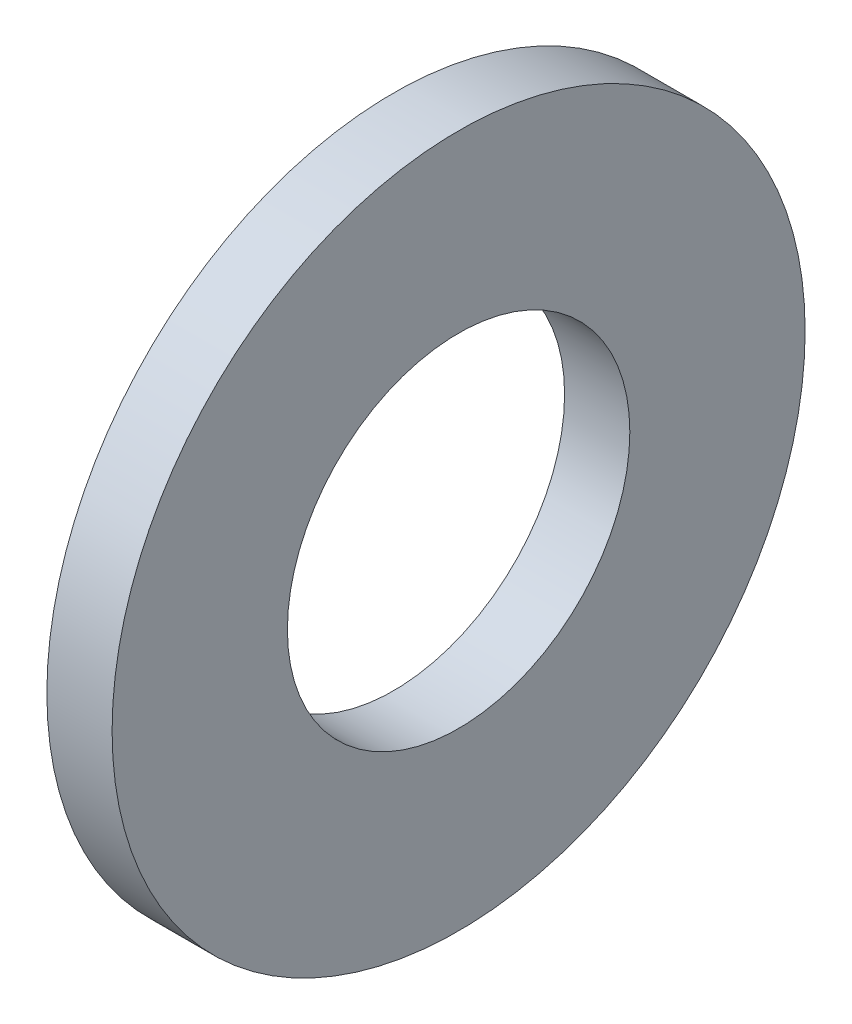
ISO-10303-21;
HEADER;
FILE_DESCRIPTION(('STEP AP214'),'2;1');
FILE_NAME('part.step','',(''),(''),'','','');
FILE_SCHEMA(('AUTOMOTIVE_DESIGN { 1 0 10303 214 1 1 1 1 }'));
ENDSEC;
DATA;
#1=APPLICATION_CONTEXT('core data for automotive mechanical design processes');
#2=APPLICATION_PROTOCOL_DEFINITION('international standard','automotive_design',2000,#1);
#3=PRODUCT_CONTEXT('',#1,'mechanical');
#4=PRODUCT('Part','Part','',(#3));
#5=PRODUCT_RELATED_PRODUCT_CATEGORY('part','',(#4));
#6=PRODUCT_DEFINITION_FORMATION('','',#4);
#7=PRODUCT_DEFINITION_CONTEXT('part definition',#1,'design');
#8=PRODUCT_DEFINITION('design','',#6,#7);
#9=PRODUCT_DEFINITION_SHAPE('','',#8);
#10=(LENGTH_UNIT() NAMED_UNIT(*) SI_UNIT(.MILLI.,.METRE.));
#11=(NAMED_UNIT(*) PLANE_ANGLE_UNIT() SI_UNIT($,.RADIAN.));
#12=(NAMED_UNIT(*) SI_UNIT($,.STERADIAN.) SOLID_ANGLE_UNIT());
#13=UNCERTAINTY_MEASURE_WITH_UNIT(LENGTH_MEASURE(1.E-05),#10,'distance_accuracy_value','');
#14=(GEOMETRIC_REPRESENTATION_CONTEXT(3) GLOBAL_UNCERTAINTY_ASSIGNED_CONTEXT((#13)) GLOBAL_UNIT_ASSIGNED_CONTEXT((#10,
#11,#12)) REPRESENTATION_CONTEXT('',''));
#15=CARTESIAN_POINT('',(0.,0.,0.));
#16=DIRECTION('',(0.,0.,1.));
#17=DIRECTION('',(1.,0.,0.));
#18=AXIS2_PLACEMENT_3D('',#15,#16,#17);
#19=CARTESIAN_POINT('',(-0.8,6.35,0.));
#20=DIRECTION('',(-1.,0.,0.));
#21=DIRECTION('',(0.,0.,1.));
#22=AXIS2_PLACEMENT_3D('',#19,#20,#21);
#23=PLANE('',#22);
#24=CARTESIAN_POINT('',(-0.8,0.,0.));
#25=DIRECTION('',(1.,0.,0.));
#26=DIRECTION('',(0.,0.,-1.));
#27=AXIS2_PLACEMENT_3D('',#24,#25,#26);
#28=CIRCLE('',#27,8.5);
#29=CARTESIAN_POINT('',(-0.8,0.,-8.5));
#30=VERTEX_POINT('',#29);
#31=EDGE_CURVE('E19',#30,#30,#28,.T.);
#32=ORIENTED_EDGE('',*,*,#31,.F.);
#33=EDGE_LOOP('',(#32));
#34=FACE_BOUND('',#33,.T.);
#35=CARTESIAN_POINT('',(-0.8,0.,0.));
#36=DIRECTION('',(1.,0.,0.));
#37=DIRECTION('',(0.,0.,-1.));
#38=AXIS2_PLACEMENT_3D('',#35,#36,#37);
#39=CIRCLE('',#38,4.2);
#40=CARTESIAN_POINT('',(-0.8,0.,-4.2));
#41=VERTEX_POINT('',#40);
#42=EDGE_CURVE('E31',#41,#41,#39,.T.);
#43=ORIENTED_EDGE('',*,*,#42,.T.);
#44=EDGE_LOOP('',(#43));
#45=FACE_BOUND('',#44,.T.);
#46=ADVANCED_FACE('F16',(#34,#45),#23,.T.);
#47=CARTESIAN_POINT('',(0.,0.,0.));
#48=DIRECTION('',(1.,0.,0.));
#49=DIRECTION('',(0.,0.,-1.));
#50=AXIS2_PLACEMENT_3D('',#47,#48,#49);
#51=CYLINDRICAL_SURFACE('',#50,8.5);
#52=ORIENTED_EDGE('',*,*,#31,.T.);
#53=EDGE_LOOP('',(#52));
#54=FACE_BOUND('',#53,.T.);
#55=CARTESIAN_POINT('',(0.8,0.,0.));
#56=DIRECTION('',(1.,0.,0.));
#57=DIRECTION('',(0.,0.,-1.));
#58=AXIS2_PLACEMENT_3D('',#55,#56,#57);
#59=CIRCLE('',#58,8.5);
#60=CARTESIAN_POINT('',(0.8,0.,-8.5));
#61=VERTEX_POINT('',#60);
#62=EDGE_CURVE('E24',#61,#61,#59,.T.);
#63=ORIENTED_EDGE('',*,*,#62,.F.);
#64=EDGE_LOOP('',(#63));
#65=FACE_BOUND('',#64,.T.);
#66=ADVANCED_FACE('F42',(#54,#65),#51,.T.);
#67=CARTESIAN_POINT('',(0.,0.,0.));
#68=DIRECTION('',(1.,0.,0.));
#69=DIRECTION('',(0.,0.,-1.));
#70=AXIS2_PLACEMENT_3D('',#67,#68,#69);
#71=CYLINDRICAL_SURFACE('',#70,4.2);
#72=CARTESIAN_POINT('',(0.8,0.,0.));
#73=DIRECTION('',(1.,0.,0.));
#74=DIRECTION('',(0.,0.,-1.));
#75=AXIS2_PLACEMENT_3D('',#72,#73,#74);
#76=CIRCLE('',#75,4.2);
#77=CARTESIAN_POINT('',(0.8,0.,-4.2));
#78=VERTEX_POINT('',#77);
#79=EDGE_CURVE('E10',#78,#78,#76,.F.);
#80=ORIENTED_EDGE('',*,*,#79,.F.);
#81=EDGE_LOOP('',(#80));
#82=FACE_BOUND('',#81,.T.);
#83=ORIENTED_EDGE('',*,*,#42,.F.);
#84=EDGE_LOOP('',(#83));
#85=FACE_BOUND('',#84,.T.);
#86=ADVANCED_FACE('F49',(#82,#85),#71,.F.);
#87=CARTESIAN_POINT('',(0.8,6.35,0.));
#88=DIRECTION('',(1.,0.,0.));
#89=DIRECTION('',(0.,0.,-1.));
#90=AXIS2_PLACEMENT_3D('',#87,#88,#89);
#91=PLANE('',#90);
#92=ORIENTED_EDGE('',*,*,#79,.T.);
#93=EDGE_LOOP('',(#92));
#94=FACE_BOUND('',#93,.T.);
#95=ORIENTED_EDGE('',*,*,#62,.T.);
#96=EDGE_LOOP('',(#95));
#97=FACE_BOUND('',#96,.T.);
#98=ADVANCED_FACE('F50',(#94,#97),#91,.T.);
#99=CLOSED_SHELL('',(#46,#66,#86,#98));
#100=MANIFOLD_SOLID_BREP('B1',#99);
#101=ADVANCED_BREP_SHAPE_REPRESENTATION('',(#18,#100),#14);
#102=SHAPE_DEFINITION_REPRESENTATION(#9,#101);
ENDSEC;
END-ISO-10303-21;
